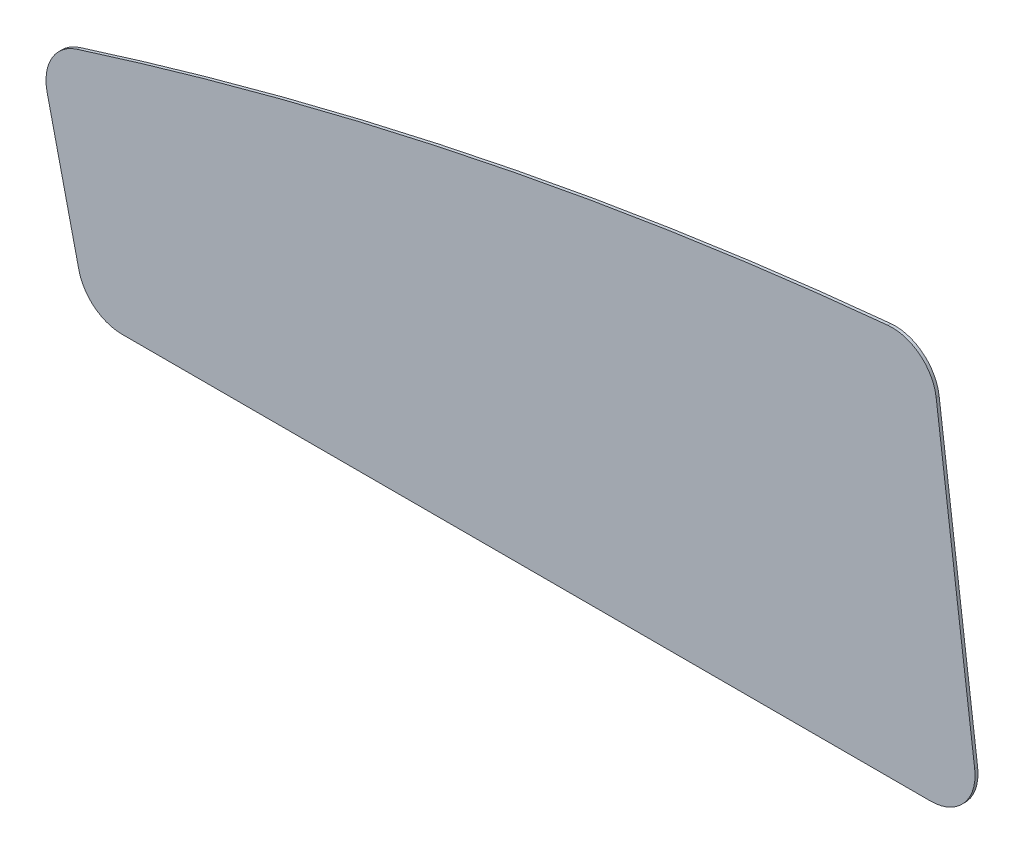
ISO-10303-21;
HEADER;
FILE_DESCRIPTION(('STEP AP214'),'2;1');
FILE_NAME('part.step','',(''),(''),'','','');
FILE_SCHEMA(('AUTOMOTIVE_DESIGN { 1 0 10303 214 1 1 1 1 }'));
ENDSEC;
DATA;
#1=APPLICATION_CONTEXT('core data for automotive mechanical design processes');
#2=APPLICATION_PROTOCOL_DEFINITION('international standard','automotive_design',2000,#1);
#3=PRODUCT_CONTEXT('',#1,'mechanical');
#4=PRODUCT('Part','Part','',(#3));
#5=PRODUCT_RELATED_PRODUCT_CATEGORY('part','',(#4));
#6=PRODUCT_DEFINITION_FORMATION('','',#4);
#7=PRODUCT_DEFINITION_CONTEXT('part definition',#1,'design');
#8=PRODUCT_DEFINITION('design','',#6,#7);
#9=PRODUCT_DEFINITION_SHAPE('','',#8);
#10=(LENGTH_UNIT() NAMED_UNIT(*) SI_UNIT(.MILLI.,.METRE.));
#11=(NAMED_UNIT(*) PLANE_ANGLE_UNIT() SI_UNIT($,.RADIAN.));
#12=(NAMED_UNIT(*) SI_UNIT($,.STERADIAN.) SOLID_ANGLE_UNIT());
#13=UNCERTAINTY_MEASURE_WITH_UNIT(LENGTH_MEASURE(1.E-05),#10,'distance_accuracy_value','');
#14=(GEOMETRIC_REPRESENTATION_CONTEXT(3) GLOBAL_UNCERTAINTY_ASSIGNED_CONTEXT((#13)) GLOBAL_UNIT_ASSIGNED_CONTEXT((#10,
#11,#12)) REPRESENTATION_CONTEXT('',''));
#15=CARTESIAN_POINT('',(0.,0.,0.));
#16=DIRECTION('',(0.,0.,1.));
#17=DIRECTION('',(1.,0.,0.));
#18=AXIS2_PLACEMENT_3D('',#15,#16,#17);
#19=CARTESIAN_POINT('',(354.76227920701,178.812690763428,1.));
#20=DIRECTION('',(0.,0.,-1.));
#21=DIRECTION('',(-1.,0.,0.));
#22=AXIS2_PLACEMENT_3D('',#19,#20,#21);
#23=CYLINDRICAL_SURFACE('',#22,15.0000000000001);
#24=CARTESIAN_POINT('',(354.76227920701,178.812690763428,0.));
#25=DIRECTION('',(0.,0.,1.));
#26=DIRECTION('',(1.,0.,0.));
#27=AXIS2_PLACEMENT_3D('',#24,#25,#26);
#28=CIRCLE('',#27,15.0000000000001);
#29=CARTESIAN_POINT('',(369.641986092026,180.708560752639,0.));
#30=VERTEX_POINT('',#29);
#31=CARTESIAN_POINT('',(353.330083137085,193.74416136807,0.));
#32=VERTEX_POINT('',#31);
#33=EDGE_CURVE('E133',#30,#32,#28,.T.);
#34=ORIENTED_EDGE('',*,*,#33,.T.);
#35=DIRECTION('',(0.,0.,-1.));
#36=VECTOR('',#35,1.);
#37=CARTESIAN_POINT('',(353.330083137085,193.74416136807,1.));
#38=LINE('',#37,#36);
#39=CARTESIAN_POINT('',(353.330083137085,193.74416136807,1.));
#40=VERTEX_POINT('',#39);
#41=EDGE_CURVE('E11',#40,#32,#38,.T.);
#42=ORIENTED_EDGE('',*,*,#41,.F.);
#43=CARTESIAN_POINT('',(354.76227920701,178.812690763428,1.));
#44=DIRECTION('',(0.,0.,1.));
#45=DIRECTION('',(1.,0.,0.));
#46=AXIS2_PLACEMENT_3D('',#43,#44,#45);
#47=CIRCLE('',#46,15.0000000000001);
#48=CARTESIAN_POINT('',(369.641986092026,180.708560752639,1.));
#49=VERTEX_POINT('',#48);
#50=EDGE_CURVE('E152',#49,#40,#47,.T.);
#51=ORIENTED_EDGE('',*,*,#50,.F.);
#52=DIRECTION('',(0.,0.,-1.));
#53=VECTOR('',#52,1.);
#54=CARTESIAN_POINT('',(369.641986092026,180.708560752639,1.));
#55=LINE('',#54,#53);
#56=EDGE_CURVE('E129',#49,#30,#55,.T.);
#57=ORIENTED_EDGE('',*,*,#56,.T.);
#58=EDGE_LOOP('',(#34,#42,#51,#57));
#59=FACE_BOUND('',#58,.T.);
#60=ADVANCED_FACE('F37',(#59),#23,.T.);
#61=CARTESIAN_POINT('',(353.330083137085,193.74416136807,1.));
#62=CARTESIAN_POINT('',(260.762756375817,184.865293030097,1.));
#63=CARTESIAN_POINT('',(169.384224686071,166.118380170071,1.));
#64=CARTESIAN_POINT('',(79.1944880677695,137.503422787966,1.));
#65=B_SPLINE_CURVE_WITH_KNOTS('',3,(#61,#62,#63,#64),.UNSPECIFIED.,.F.,.F.,(4,4),
(0.0316426666979729,0.681355193411916),.UNSPECIFIED.);
#66=DIRECTION('',(0.,0.,-1.));
#67=VECTOR('',#66,1.);
#68=SURFACE_OF_LINEAR_EXTRUSION('',#65,#67);
#69=CARTESIAN_POINT('',(353.330083137085,193.74416136807,0.));
#70=CARTESIAN_POINT('',(260.762756375817,184.865293030097,0.));
#71=CARTESIAN_POINT('',(169.384224686071,166.118380170071,0.));
#72=CARTESIAN_POINT('',(79.1944880677695,137.503422787966,0.));
#73=B_SPLINE_CURVE_WITH_KNOTS('',3,(#69,#70,#71,#72),.UNSPECIFIED.,.F.,.F.,(4,4),
(0.0316426666979729,0.681355193411916),.UNSPECIFIED.);
#74=CARTESIAN_POINT('',(79.1944880677695,137.503422787966,0.));
#75=VERTEX_POINT('',#74);
#76=EDGE_CURVE('E136',#32,#75,#73,.T.);
#77=ORIENTED_EDGE('',*,*,#76,.T.);
#78=DIRECTION('',(0.,0.,-1.));
#79=VECTOR('',#78,1.);
#80=CARTESIAN_POINT('',(79.1944880677695,137.503422787966,1.));
#81=LINE('',#80,#79);
#82=CARTESIAN_POINT('',(79.1944880677695,137.503422787966,1.));
#83=VERTEX_POINT('',#82);
#84=EDGE_CURVE('E45',#83,#75,#81,.T.);
#85=ORIENTED_EDGE('',*,*,#84,.F.);
#86=EDGE_CURVE('E96',#40,#83,#65,.T.);
#87=ORIENTED_EDGE('',*,*,#86,.F.);
#88=ORIENTED_EDGE('',*,*,#41,.T.);
#89=EDGE_LOOP('',(#77,#85,#87,#88));
#90=FACE_BOUND('',#89,.T.);
#91=ADVANCED_FACE('F190',(#90),#68,.F.);
#92=CARTESIAN_POINT('',(83.7307692241898,123.205795248059,1.));
#93=DIRECTION('',(0.,0.,-1.));
#94=DIRECTION('',(-1.,0.,0.));
#95=AXIS2_PLACEMENT_3D('',#92,#93,#94);
#96=CYLINDRICAL_SURFACE('',#95,15.);
#97=CARTESIAN_POINT('',(83.7307692241898,123.205795248059,0.));
#98=DIRECTION('',(0.,0.,1.));
#99=DIRECTION('',(1.,0.,0.));
#100=AXIS2_PLACEMENT_3D('',#97,#98,#99);
#101=CIRCLE('',#100,15.);
#102=CARTESIAN_POINT('',(69.1131308989028,119.840583547274,0.));
#103=VERTEX_POINT('',#102);
#104=EDGE_CURVE('E140',#75,#103,#101,.T.);
#105=ORIENTED_EDGE('',*,*,#104,.T.);
#106=DIRECTION('',(0.,0.,-1.));
#107=VECTOR('',#106,1.);
#108=CARTESIAN_POINT('',(69.1131308989028,119.840583547274,1.));
#109=LINE('',#108,#107);
#110=CARTESIAN_POINT('',(69.1131308989028,119.840583547274,1.));
#111=VERTEX_POINT('',#110);
#112=EDGE_CURVE('E159',#111,#103,#109,.T.);
#113=ORIENTED_EDGE('',*,*,#112,.F.);
#114=CARTESIAN_POINT('',(83.7307692241898,123.205795248059,1.));
#115=DIRECTION('',(0.,0.,1.));
#116=DIRECTION('',(1.,0.,0.));
#117=AXIS2_PLACEMENT_3D('',#114,#115,#116);
#118=CIRCLE('',#117,15.);
#119=EDGE_CURVE('E167',#83,#111,#118,.T.);
#120=ORIENTED_EDGE('',*,*,#119,.F.);
#121=ORIENTED_EDGE('',*,*,#84,.T.);
#122=EDGE_LOOP('',(#105,#113,#120,#121));
#123=FACE_BOUND('',#122,.T.);
#124=ADVANCED_FACE('F165',(#123),#96,.T.);
#125=CARTESIAN_POINT('',(69.1131308989028,119.840583547274,1.));
#126=DIRECTION('',(0.974509221685794,0.224347446719031,0.));
#127=DIRECTION('',(-0.224347446719031,0.974509221685794,0.));
#128=AXIS2_PLACEMENT_3D('',#125,#126,#127);
#129=PLANE('',#128);
#130=DIRECTION('',(0.224347446719031,-0.974509221685794,0.));
#131=VECTOR('',#130,1.);
#132=CARTESIAN_POINT('',(69.1131308989028,119.840583547274,0.));
#133=LINE('',#132,#131);
#134=CARTESIAN_POINT('',(79.8269600659794,73.3023881027848,0.));
#135=VERTEX_POINT('',#134);
#136=EDGE_CURVE('E145',#103,#135,#133,.T.);
#137=ORIENTED_EDGE('',*,*,#136,.T.);
#138=DIRECTION('',(0.,0.,-1.));
#139=VECTOR('',#138,1.);
#140=CARTESIAN_POINT('',(79.8269600659794,73.3023881027848,1.));
#141=LINE('',#140,#139);
#142=CARTESIAN_POINT('',(79.8269600659794,73.3023881027848,1.));
#143=VERTEX_POINT('',#142);
#144=EDGE_CURVE('E156',#143,#135,#141,.T.);
#145=ORIENTED_EDGE('',*,*,#144,.F.);
#146=DIRECTION('',(0.224347446719031,-0.974509221685794,0.));
#147=VECTOR('',#146,1.);
#148=CARTESIAN_POINT('',(69.1131308989028,119.840583547274,1.));
#149=LINE('',#148,#147);
#150=EDGE_CURVE('E179',#111,#143,#149,.T.);
#151=ORIENTED_EDGE('',*,*,#150,.F.);
#152=ORIENTED_EDGE('',*,*,#112,.T.);
#153=EDGE_LOOP('',(#137,#145,#151,#152));
#154=FACE_BOUND('',#153,.T.);
#155=ADVANCED_FACE('F175',(#154),#129,.F.);
#156=CARTESIAN_POINT('',(94.4445983912663,76.6675998035703,1.));
#157=DIRECTION('',(0.,0.,-1.));
#158=DIRECTION('',(-1.,0.,0.));
#159=AXIS2_PLACEMENT_3D('',#156,#157,#158);
#160=CYLINDRICAL_SURFACE('',#159,15.);
#161=CARTESIAN_POINT('',(94.4445983912663,76.6675998035703,0.));
#162=DIRECTION('',(0.,0.,1.));
#163=DIRECTION('',(1.,0.,0.));
#164=AXIS2_PLACEMENT_3D('',#161,#162,#163);
#165=CIRCLE('',#164,15.);
#166=CARTESIAN_POINT('',(94.4445983912663,61.6675998035703,0.));
#167=VERTEX_POINT('',#166);
#168=EDGE_CURVE('E147',#135,#167,#165,.T.);
#169=ORIENTED_EDGE('',*,*,#168,.T.);
#170=DIRECTION('',(0.,0.,-1.));
#171=VECTOR('',#170,1.);
#172=CARTESIAN_POINT('',(94.4445983912663,61.6675998035703,1.));
#173=LINE('',#172,#171);
#174=CARTESIAN_POINT('',(94.4445983912663,61.6675998035703,1.));
#175=VERTEX_POINT('',#174);
#176=EDGE_CURVE('E124',#175,#167,#173,.T.);
#177=ORIENTED_EDGE('',*,*,#176,.F.);
#178=CARTESIAN_POINT('',(94.4445983912663,76.6675998035703,1.));
#179=DIRECTION('',(0.,0.,1.));
#180=DIRECTION('',(1.,0.,0.));
#181=AXIS2_PLACEMENT_3D('',#178,#179,#180);
#182=CIRCLE('',#181,15.);
#183=EDGE_CURVE('E115',#143,#175,#182,.T.);
#184=ORIENTED_EDGE('',*,*,#183,.F.);
#185=ORIENTED_EDGE('',*,*,#144,.T.);
#186=EDGE_LOOP('',(#169,#177,#184,#185));
#187=FACE_BOUND('',#186,.T.);
#188=ADVANCED_FACE('F178',(#187),#160,.T.);
#189=CARTESIAN_POINT('',(94.4445983912663,61.6675998035703,1.));
#190=DIRECTION('',(0.,1.,0.));
#191=DIRECTION('',(0.,0.,1.));
#192=AXIS2_PLACEMENT_3D('',#189,#190,#191);
#193=PLANE('',#192);
#194=DIRECTION('',(1.,0.,0.));
#195=VECTOR('',#194,1.);
#196=CARTESIAN_POINT('',(94.4445983912663,61.6675998035703,0.));
#197=LINE('',#196,#195);
#198=CARTESIAN_POINT('',(367.776904696104,61.6675998035703,0.));
#199=VERTEX_POINT('',#198);
#200=EDGE_CURVE('E123',#167,#199,#197,.T.);
#201=ORIENTED_EDGE('',*,*,#200,.T.);
#202=DIRECTION('',(0.,0.,-1.));
#203=VECTOR('',#202,1.);
#204=CARTESIAN_POINT('',(367.776904696104,61.6675998035703,1.));
#205=LINE('',#204,#203);
#206=CARTESIAN_POINT('',(367.776904696104,61.6675998035703,1.));
#207=VERTEX_POINT('',#206);
#208=EDGE_CURVE('E120',#207,#199,#205,.T.);
#209=ORIENTED_EDGE('',*,*,#208,.F.);
#210=DIRECTION('',(1.,0.,0.));
#211=VECTOR('',#210,1.);
#212=CARTESIAN_POINT('',(94.4445983912663,61.6675998035703,1.));
#213=LINE('',#212,#211);
#214=EDGE_CURVE('E109',#175,#207,#213,.T.);
#215=ORIENTED_EDGE('',*,*,#214,.F.);
#216=ORIENTED_EDGE('',*,*,#176,.T.);
#217=EDGE_LOOP('',(#201,#209,#215,#216));
#218=FACE_BOUND('',#217,.T.);
#219=ADVANCED_FACE('F121',(#218),#193,.F.);
#220=CARTESIAN_POINT('',(367.776904696104,76.6675998035703,1.));
#221=DIRECTION('',(0.,0.,-1.));
#222=DIRECTION('',(-1.,0.,0.));
#223=AXIS2_PLACEMENT_3D('',#220,#221,#222);
#224=CYLINDRICAL_SURFACE('',#223,15.);
#225=CARTESIAN_POINT('',(367.776904696104,76.6675998035703,0.));
#226=DIRECTION('',(0.,0.,1.));
#227=DIRECTION('',(1.,0.,0.));
#228=AXIS2_PLACEMENT_3D('',#225,#226,#227);
#229=CIRCLE('',#228,15.);
#230=CARTESIAN_POINT('',(382.65661158112,78.5634697927809,0.));
#231=VERTEX_POINT('',#230);
#232=EDGE_CURVE('E82',#199,#231,#229,.T.);
#233=ORIENTED_EDGE('',*,*,#232,.T.);
#234=DIRECTION('',(0.,0.,-1.));
#235=VECTOR('',#234,1.);
#236=CARTESIAN_POINT('',(382.65661158112,78.5634697927809,1.));
#237=LINE('',#236,#235);
#238=CARTESIAN_POINT('',(382.65661158112,78.5634697927809,1.));
#239=VERTEX_POINT('',#238);
#240=EDGE_CURVE('E125',#239,#231,#237,.T.);
#241=ORIENTED_EDGE('',*,*,#240,.F.);
#242=CARTESIAN_POINT('',(367.776904696104,76.6675998035703,1.));
#243=DIRECTION('',(0.,0.,1.));
#244=DIRECTION('',(1.,0.,0.));
#245=AXIS2_PLACEMENT_3D('',#242,#243,#244);
#246=CIRCLE('',#245,15.);
#247=EDGE_CURVE('E113',#207,#239,#246,.T.);
#248=ORIENTED_EDGE('',*,*,#247,.F.);
#249=ORIENTED_EDGE('',*,*,#208,.T.);
#250=EDGE_LOOP('',(#233,#241,#248,#249));
#251=FACE_BOUND('',#250,.T.);
#252=ADVANCED_FACE('F127',(#251),#224,.T.);
#253=CARTESIAN_POINT('',(382.65661158112,78.5634697927809,1.));
#254=DIRECTION('',(-0.991980459001107,-0.126391332614041,0.));
#255=DIRECTION('',(0.126391332614041,-0.991980459001107,0.));
#256=AXIS2_PLACEMENT_3D('',#253,#254,#255);
#257=PLANE('',#256);
#258=DIRECTION('',(-0.126391332614041,0.991980459001107,0.));
#259=VECTOR('',#258,1.);
#260=CARTESIAN_POINT('',(382.65661158112,78.5634697927809,0.));
#261=LINE('',#260,#259);
#262=EDGE_CURVE('E88',#231,#30,#261,.T.);
#263=ORIENTED_EDGE('',*,*,#262,.T.);
#264=ORIENTED_EDGE('',*,*,#56,.F.);
#265=DIRECTION('',(-0.126391332614041,0.991980459001107,0.));
#266=VECTOR('',#265,1.);
#267=CARTESIAN_POINT('',(382.65661158112,78.5634697927809,1.));
#268=LINE('',#267,#266);
#269=EDGE_CURVE('E53',#239,#49,#268,.T.);
#270=ORIENTED_EDGE('',*,*,#269,.F.);
#271=ORIENTED_EDGE('',*,*,#240,.T.);
#272=EDGE_LOOP('',(#263,#264,#270,#271));
#273=FACE_BOUND('',#272,.T.);
#274=ADVANCED_FACE('F203',(#273),#257,.F.);
#275=CARTESIAN_POINT('',(354.76227920701,178.812690763428,1.));
#276=DIRECTION('',(0.,0.,1.));
#277=DIRECTION('',(1.,0.,0.));
#278=AXIS2_PLACEMENT_3D('',#275,#276,#277);
#279=PLANE('',#278);
#280=ORIENTED_EDGE('',*,*,#50,.T.);
#281=ORIENTED_EDGE('',*,*,#86,.T.);
#282=ORIENTED_EDGE('',*,*,#119,.T.);
#283=ORIENTED_EDGE('',*,*,#150,.T.);
#284=ORIENTED_EDGE('',*,*,#183,.T.);
#285=ORIENTED_EDGE('',*,*,#214,.T.);
#286=ORIENTED_EDGE('',*,*,#247,.T.);
#287=ORIENTED_EDGE('',*,*,#269,.T.);
#288=EDGE_LOOP('',(#280,#281,#282,#283,#284,#285,#286,#287));
#289=FACE_BOUND('',#288,.T.);
#290=ADVANCED_FACE('F111',(#289),#279,.T.);
#291=CARTESIAN_POINT('',(354.76227920701,178.812690763428,0.));
#292=DIRECTION('',(0.,0.,1.));
#293=DIRECTION('',(1.,0.,0.));
#294=AXIS2_PLACEMENT_3D('',#291,#292,#293);
#295=PLANE('',#294);
#296=ORIENTED_EDGE('',*,*,#33,.F.);
#297=ORIENTED_EDGE('',*,*,#262,.F.);
#298=ORIENTED_EDGE('',*,*,#232,.F.);
#299=ORIENTED_EDGE('',*,*,#200,.F.);
#300=ORIENTED_EDGE('',*,*,#168,.F.);
#301=ORIENTED_EDGE('',*,*,#136,.F.);
#302=ORIENTED_EDGE('',*,*,#104,.F.);
#303=ORIENTED_EDGE('',*,*,#76,.F.);
#304=EDGE_LOOP('',(#296,#297,#298,#299,#300,#301,#302,#303));
#305=FACE_BOUND('',#304,.T.);
#306=ADVANCED_FACE('F171',(#305),#295,.F.);
#307=CLOSED_SHELL('',(#60,#91,#124,#155,#188,#219,#252,#274,#290,#306));
#308=MANIFOLD_SOLID_BREP('B2',#307);
#309=ADVANCED_BREP_SHAPE_REPRESENTATION('',(#18,#308),#14);
#310=SHAPE_DEFINITION_REPRESENTATION(#9,#309);
ENDSEC;
END-ISO-10303-21;
